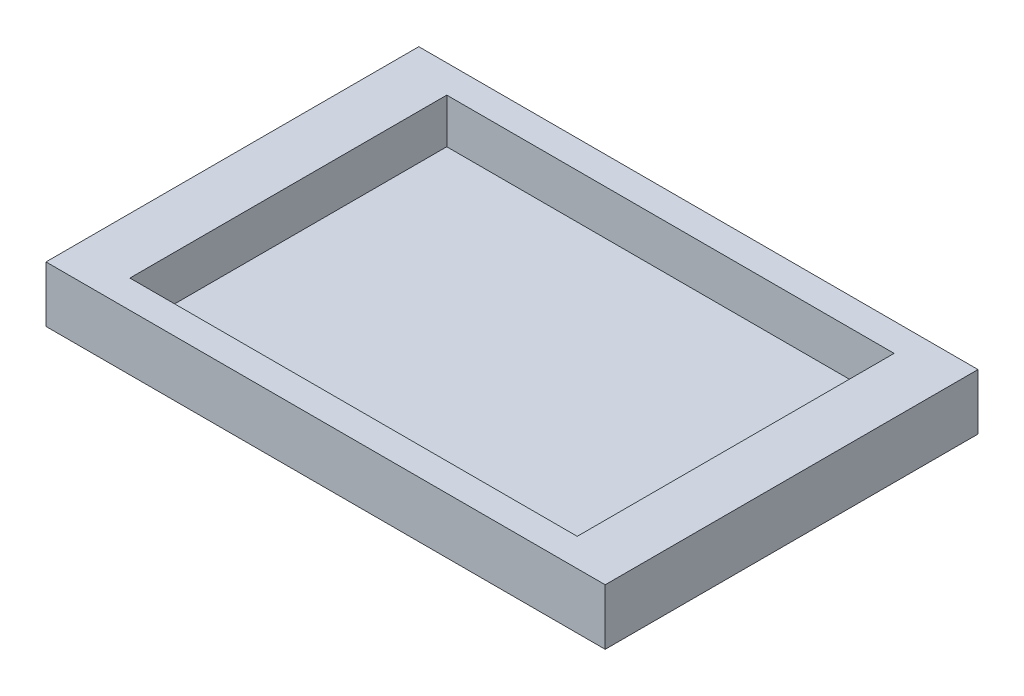
ISO-10303-21;
HEADER;
FILE_DESCRIPTION(('STEP AP214'),'2;1');
FILE_NAME('part.step','',(''),(''),'','','');
FILE_SCHEMA(('AUTOMOTIVE_DESIGN { 1 0 10303 214 1 1 1 1 }'));
ENDSEC;
DATA;
#1=APPLICATION_CONTEXT('core data for automotive mechanical design processes');
#2=APPLICATION_PROTOCOL_DEFINITION('international standard','automotive_design',2000,#1);
#3=PRODUCT_CONTEXT('',#1,'mechanical');
#4=PRODUCT('Part','Part','',(#3));
#5=PRODUCT_RELATED_PRODUCT_CATEGORY('part','',(#4));
#6=PRODUCT_DEFINITION_FORMATION('','',#4);
#7=PRODUCT_DEFINITION_CONTEXT('part definition',#1,'design');
#8=PRODUCT_DEFINITION('design','',#6,#7);
#9=PRODUCT_DEFINITION_SHAPE('','',#8);
#10=(LENGTH_UNIT() NAMED_UNIT(*) SI_UNIT(.MILLI.,.METRE.));
#11=(NAMED_UNIT(*) PLANE_ANGLE_UNIT() SI_UNIT($,.RADIAN.));
#12=(NAMED_UNIT(*) SI_UNIT($,.STERADIAN.) SOLID_ANGLE_UNIT());
#13=UNCERTAINTY_MEASURE_WITH_UNIT(LENGTH_MEASURE(1.E-05),#10,'distance_accuracy_value','');
#14=(GEOMETRIC_REPRESENTATION_CONTEXT(3) GLOBAL_UNCERTAINTY_ASSIGNED_CONTEXT((#13)) GLOBAL_UNIT_ASSIGNED_CONTEXT((#10,
#11,#12)) REPRESENTATION_CONTEXT('',''));
#15=CARTESIAN_POINT('',(0.,0.,0.));
#16=DIRECTION('',(0.,0.,1.));
#17=DIRECTION('',(1.,0.,0.));
#18=AXIS2_PLACEMENT_3D('',#15,#16,#17);
#19=CARTESIAN_POINT('',(75.,15.,-50.));
#20=DIRECTION('',(-1.,0.,0.));
#21=DIRECTION('',(0.,0.,1.));
#22=AXIS2_PLACEMENT_3D('',#19,#20,#21);
#23=PLANE('',#22);
#24=DIRECTION('',(0.,0.,-1.));
#25=VECTOR('',#24,1.);
#26=CARTESIAN_POINT('',(75.,0.,-50.));
#27=LINE('',#26,#25);
#28=CARTESIAN_POINT('',(75.,0.,50.));
#29=VERTEX_POINT('',#28);
#30=CARTESIAN_POINT('',(75.,0.,-50.));
#31=VERTEX_POINT('',#30);
#32=EDGE_CURVE('E142',#29,#31,#27,.T.);
#33=ORIENTED_EDGE('',*,*,#32,.T.);
#34=DIRECTION('',(0.,-1.,0.));
#35=VECTOR('',#34,1.);
#36=CARTESIAN_POINT('',(75.,15.,-50.));
#37=LINE('',#36,#35);
#38=CARTESIAN_POINT('',(75.,15.,-50.));
#39=VERTEX_POINT('',#38);
#40=EDGE_CURVE('E11',#39,#31,#37,.T.);
#41=ORIENTED_EDGE('',*,*,#40,.F.);
#42=DIRECTION('',(0.,0.,-1.));
#43=VECTOR('',#42,1.);
#44=CARTESIAN_POINT('',(75.,15.,-50.));
#45=LINE('',#44,#43);
#46=CARTESIAN_POINT('',(75.,15.,50.));
#47=VERTEX_POINT('',#46);
#48=EDGE_CURVE('E146',#47,#39,#45,.T.);
#49=ORIENTED_EDGE('',*,*,#48,.F.);
#50=DIRECTION('',(0.,-1.,0.));
#51=VECTOR('',#50,1.);
#52=CARTESIAN_POINT('',(75.,15.,50.));
#53=LINE('',#52,#51);
#54=EDGE_CURVE('E152',#47,#29,#53,.T.);
#55=ORIENTED_EDGE('',*,*,#54,.T.);
#56=EDGE_LOOP('',(#33,#41,#49,#55));
#57=FACE_BOUND('',#56,.T.);
#58=ADVANCED_FACE('F34',(#57),#23,.F.);
#59=CARTESIAN_POINT('',(-75.,15.,-50.));
#60=DIRECTION('',(0.,0.,1.));
#61=DIRECTION('',(1.,0.,0.));
#62=AXIS2_PLACEMENT_3D('',#59,#60,#61);
#63=PLANE('',#62);
#64=DIRECTION('',(-1.,0.,0.));
#65=VECTOR('',#64,1.);
#66=CARTESIAN_POINT('',(-75.,0.,-50.));
#67=LINE('',#66,#65);
#68=CARTESIAN_POINT('',(-75.,0.,-50.));
#69=VERTEX_POINT('',#68);
#70=EDGE_CURVE('E155',#31,#69,#67,.T.);
#71=ORIENTED_EDGE('',*,*,#70,.T.);
#72=DIRECTION('',(0.,-1.,0.));
#73=VECTOR('',#72,1.);
#74=CARTESIAN_POINT('',(-75.,15.,-50.));
#75=LINE('',#74,#73);
#76=CARTESIAN_POINT('',(-75.,15.,-50.));
#77=VERTEX_POINT('',#76);
#78=EDGE_CURVE('E41',#77,#69,#75,.T.);
#79=ORIENTED_EDGE('',*,*,#78,.F.);
#80=DIRECTION('',(-1.,0.,0.));
#81=VECTOR('',#80,1.);
#82=CARTESIAN_POINT('',(-75.,15.,-50.));
#83=LINE('',#82,#81);
#84=EDGE_CURVE('E85',#39,#77,#83,.T.);
#85=ORIENTED_EDGE('',*,*,#84,.F.);
#86=ORIENTED_EDGE('',*,*,#40,.T.);
#87=EDGE_LOOP('',(#71,#79,#85,#86));
#88=FACE_BOUND('',#87,.T.);
#89=ADVANCED_FACE('F184',(#88),#63,.F.);
#90=CARTESIAN_POINT('',(-75.,15.,-50.));
#91=DIRECTION('',(1.,0.,0.));
#92=DIRECTION('',(0.,0.,-1.));
#93=AXIS2_PLACEMENT_3D('',#90,#91,#92);
#94=PLANE('',#93);
#95=DIRECTION('',(0.,0.,1.));
#96=VECTOR('',#95,1.);
#97=CARTESIAN_POINT('',(-75.,0.,-50.));
#98=LINE('',#97,#96);
#99=CARTESIAN_POINT('',(-75.,0.,50.));
#100=VERTEX_POINT('',#99);
#101=EDGE_CURVE('E157',#69,#100,#98,.T.);
#102=ORIENTED_EDGE('',*,*,#101,.T.);
#103=DIRECTION('',(0.,-1.,0.));
#104=VECTOR('',#103,1.);
#105=CARTESIAN_POINT('',(-75.,15.,50.));
#106=LINE('',#105,#104);
#107=CARTESIAN_POINT('',(-75.,15.,50.));
#108=VERTEX_POINT('',#107);
#109=EDGE_CURVE('E161',#108,#100,#106,.T.);
#110=ORIENTED_EDGE('',*,*,#109,.F.);
#111=DIRECTION('',(0.,0.,1.));
#112=VECTOR('',#111,1.);
#113=CARTESIAN_POINT('',(-75.,15.,-50.));
#114=LINE('',#113,#112);
#115=EDGE_CURVE('E149',#77,#108,#114,.T.);
#116=ORIENTED_EDGE('',*,*,#115,.F.);
#117=ORIENTED_EDGE('',*,*,#78,.T.);
#118=EDGE_LOOP('',(#102,#110,#116,#117));
#119=FACE_BOUND('',#118,.T.);
#120=ADVANCED_FACE('F166',(#119),#94,.F.);
#121=CARTESIAN_POINT('',(-75.,15.,50.));
#122=DIRECTION('',(0.,0.,-1.));
#123=DIRECTION('',(-1.,0.,0.));
#124=AXIS2_PLACEMENT_3D('',#121,#122,#123);
#125=PLANE('',#124);
#126=DIRECTION('',(1.,0.,0.));
#127=VECTOR('',#126,1.);
#128=CARTESIAN_POINT('',(-75.,0.,50.));
#129=LINE('',#128,#127);
#130=EDGE_CURVE('E78',#100,#29,#129,.T.);
#131=ORIENTED_EDGE('',*,*,#130,.T.);
#132=ORIENTED_EDGE('',*,*,#54,.F.);
#133=DIRECTION('',(1.,0.,0.));
#134=VECTOR('',#133,1.);
#135=CARTESIAN_POINT('',(-75.,15.,50.));
#136=LINE('',#135,#134);
#137=EDGE_CURVE('E57',#108,#47,#136,.T.);
#138=ORIENTED_EDGE('',*,*,#137,.F.);
#139=ORIENTED_EDGE('',*,*,#109,.T.);
#140=EDGE_LOOP('',(#131,#132,#138,#139));
#141=FACE_BOUND('',#140,.T.);
#142=ADVANCED_FACE('F174',(#141),#125,.F.);
#143=CARTESIAN_POINT('',(0.,15.,0.));
#144=DIRECTION('',(0.,1.,0.));
#145=DIRECTION('',(0.,0.,1.));
#146=AXIS2_PLACEMENT_3D('',#143,#144,#145);
#147=PLANE('',#146);
#148=DIRECTION('',(0.,0.,1.));
#149=VECTOR('',#148,1.);
#150=CARTESIAN_POINT('',(-60.,15.,42.5));
#151=LINE('',#150,#149);
#152=CARTESIAN_POINT('',(-60.,15.,-42.5));
#153=VERTEX_POINT('',#152);
#154=CARTESIAN_POINT('',(-60.,15.,42.5));
#155=VERTEX_POINT('',#154);
#156=EDGE_CURVE('E48',#153,#155,#151,.T.);
#157=ORIENTED_EDGE('',*,*,#156,.F.);
#158=DIRECTION('',(-1.,0.,0.));
#159=VECTOR('',#158,1.);
#160=CARTESIAN_POINT('',(60.,15.,-42.5));
#161=LINE('',#160,#159);
#162=CARTESIAN_POINT('',(60.,15.,-42.5));
#163=VERTEX_POINT('',#162);
#164=EDGE_CURVE('E127',#163,#153,#161,.T.);
#165=ORIENTED_EDGE('',*,*,#164,.F.);
#166=DIRECTION('',(0.,0.,-1.));
#167=VECTOR('',#166,1.);
#168=CARTESIAN_POINT('',(60.,15.,42.5));
#169=LINE('',#168,#167);
#170=CARTESIAN_POINT('',(60.,15.,42.5));
#171=VERTEX_POINT('',#170);
#172=EDGE_CURVE('E130',#171,#163,#169,.T.);
#173=ORIENTED_EDGE('',*,*,#172,.F.);
#174=DIRECTION('',(1.,0.,0.));
#175=VECTOR('',#174,1.);
#176=CARTESIAN_POINT('',(60.,15.,42.5));
#177=LINE('',#176,#175);
#178=EDGE_CURVE('E136',#155,#171,#177,.T.);
#179=ORIENTED_EDGE('',*,*,#178,.F.);
#180=EDGE_LOOP('',(#157,#165,#173,#179));
#181=FACE_BOUND('',#180,.T.);
#182=ORIENTED_EDGE('',*,*,#48,.T.);
#183=ORIENTED_EDGE('',*,*,#84,.T.);
#184=ORIENTED_EDGE('',*,*,#115,.T.);
#185=ORIENTED_EDGE('',*,*,#137,.T.);
#186=EDGE_LOOP('',(#182,#183,#184,#185));
#187=FACE_BOUND('',#186,.T.);
#188=ADVANCED_FACE('F176',(#181,#187),#147,.T.);
#189=CARTESIAN_POINT('',(0.,0.,0.));
#190=DIRECTION('',(0.,1.,0.));
#191=DIRECTION('',(0.,0.,1.));
#192=AXIS2_PLACEMENT_3D('',#189,#190,#191);
#193=PLANE('',#192);
#194=ORIENTED_EDGE('',*,*,#32,.F.);
#195=ORIENTED_EDGE('',*,*,#130,.F.);
#196=ORIENTED_EDGE('',*,*,#101,.F.);
#197=ORIENTED_EDGE('',*,*,#70,.F.);
#198=EDGE_LOOP('',(#194,#195,#196,#197));
#199=FACE_BOUND('',#198,.T.);
#200=ADVANCED_FACE('F170',(#199),#193,.F.);
#201=CARTESIAN_POINT('',(-60.,3.,42.5));
#202=DIRECTION('',(-1.,0.,0.));
#203=DIRECTION('',(0.,0.,1.));
#204=AXIS2_PLACEMENT_3D('',#201,#202,#203);
#205=PLANE('',#204);
#206=ORIENTED_EDGE('',*,*,#156,.T.);
#207=DIRECTION('',(0.,1.,0.));
#208=VECTOR('',#207,1.);
#209=CARTESIAN_POINT('',(-60.,3.,42.5));
#210=LINE('',#209,#208);
#211=CARTESIAN_POINT('',(-60.,3.,42.5));
#212=VERTEX_POINT('',#211);
#213=EDGE_CURVE('E105',#212,#155,#210,.T.);
#214=ORIENTED_EDGE('',*,*,#213,.F.);
#215=DIRECTION('',(0.,0.,1.));
#216=VECTOR('',#215,1.);
#217=CARTESIAN_POINT('',(-60.,3.,42.5));
#218=LINE('',#217,#216);
#219=CARTESIAN_POINT('',(-60.,3.,-42.5));
#220=VERTEX_POINT('',#219);
#221=EDGE_CURVE('E109',#220,#212,#218,.T.);
#222=ORIENTED_EDGE('',*,*,#221,.F.);
#223=DIRECTION('',(0.,1.,0.));
#224=VECTOR('',#223,1.);
#225=CARTESIAN_POINT('',(-60.,3.,-42.5));
#226=LINE('',#225,#224);
#227=EDGE_CURVE('E140',#220,#153,#226,.T.);
#228=ORIENTED_EDGE('',*,*,#227,.T.);
#229=EDGE_LOOP('',(#206,#214,#222,#228));
#230=FACE_BOUND('',#229,.T.);
#231=ADVANCED_FACE('F107',(#230),#205,.F.);
#232=CARTESIAN_POINT('',(60.,3.,-42.5));
#233=DIRECTION('',(0.,0.,-1.));
#234=DIRECTION('',(-1.,0.,0.));
#235=AXIS2_PLACEMENT_3D('',#232,#233,#234);
#236=PLANE('',#235);
#237=ORIENTED_EDGE('',*,*,#164,.T.);
#238=ORIENTED_EDGE('',*,*,#227,.F.);
#239=DIRECTION('',(-1.,0.,0.));
#240=VECTOR('',#239,1.);
#241=CARTESIAN_POINT('',(60.,3.,-42.5));
#242=LINE('',#241,#240);
#243=CARTESIAN_POINT('',(60.,3.,-42.5));
#244=VERTEX_POINT('',#243);
#245=EDGE_CURVE('E115',#244,#220,#242,.T.);
#246=ORIENTED_EDGE('',*,*,#245,.F.);
#247=DIRECTION('',(0.,1.,0.));
#248=VECTOR('',#247,1.);
#249=CARTESIAN_POINT('',(60.,3.,-42.5));
#250=LINE('',#249,#248);
#251=EDGE_CURVE('E143',#244,#163,#250,.T.);
#252=ORIENTED_EDGE('',*,*,#251,.T.);
#253=EDGE_LOOP('',(#237,#238,#246,#252));
#254=FACE_BOUND('',#253,.T.);
#255=ADVANCED_FACE('F223',(#254),#236,.F.);
#256=CARTESIAN_POINT('',(60.,3.,42.5));
#257=DIRECTION('',(1.,0.,0.));
#258=DIRECTION('',(0.,0.,-1.));
#259=AXIS2_PLACEMENT_3D('',#256,#257,#258);
#260=PLANE('',#259);
#261=ORIENTED_EDGE('',*,*,#172,.T.);
#262=ORIENTED_EDGE('',*,*,#251,.F.);
#263=DIRECTION('',(0.,0.,-1.));
#264=VECTOR('',#263,1.);
#265=CARTESIAN_POINT('',(60.,3.,42.5));
#266=LINE('',#265,#264);
#267=CARTESIAN_POINT('',(60.,3.,42.5));
#268=VERTEX_POINT('',#267);
#269=EDGE_CURVE('E123',#268,#244,#266,.T.);
#270=ORIENTED_EDGE('',*,*,#269,.F.);
#271=DIRECTION('',(0.,1.,0.));
#272=VECTOR('',#271,1.);
#273=CARTESIAN_POINT('',(60.,3.,42.5));
#274=LINE('',#273,#272);
#275=EDGE_CURVE('E114',#268,#171,#274,.T.);
#276=ORIENTED_EDGE('',*,*,#275,.T.);
#277=EDGE_LOOP('',(#261,#262,#270,#276));
#278=FACE_BOUND('',#277,.T.);
#279=ADVANCED_FACE('F232',(#278),#260,.F.);
#280=CARTESIAN_POINT('',(60.,3.,42.5));
#281=DIRECTION('',(0.,0.,1.));
#282=DIRECTION('',(1.,0.,0.));
#283=AXIS2_PLACEMENT_3D('',#280,#281,#282);
#284=PLANE('',#283);
#285=ORIENTED_EDGE('',*,*,#178,.T.);
#286=ORIENTED_EDGE('',*,*,#275,.F.);
#287=DIRECTION('',(1.,0.,0.));
#288=VECTOR('',#287,1.);
#289=CARTESIAN_POINT('',(60.,3.,42.5));
#290=LINE('',#289,#288);
#291=EDGE_CURVE('E118',#212,#268,#290,.T.);
#292=ORIENTED_EDGE('',*,*,#291,.F.);
#293=ORIENTED_EDGE('',*,*,#213,.T.);
#294=EDGE_LOOP('',(#285,#286,#292,#293));
#295=FACE_BOUND('',#294,.T.);
#296=ADVANCED_FACE('F119',(#295),#284,.F.);
#297=CARTESIAN_POINT('',(0.,3.,0.));
#298=DIRECTION('',(0.,1.,0.));
#299=DIRECTION('',(0.,0.,1.));
#300=AXIS2_PLACEMENT_3D('',#297,#298,#299);
#301=PLANE('',#300);
#302=ORIENTED_EDGE('',*,*,#221,.T.);
#303=ORIENTED_EDGE('',*,*,#291,.T.);
#304=ORIENTED_EDGE('',*,*,#269,.T.);
#305=ORIENTED_EDGE('',*,*,#245,.T.);
#306=EDGE_LOOP('',(#302,#303,#304,#305));
#307=FACE_BOUND('',#306,.T.);
#308=ADVANCED_FACE('F125',(#307),#301,.T.);
#309=CLOSED_SHELL('',(#58,#89,#120,#142,#188,#200,#231,#255,#279,#296,#308));
#310=MANIFOLD_SOLID_BREP('B2',#309);
#311=ADVANCED_BREP_SHAPE_REPRESENTATION('',(#18,#310),#14);
#312=SHAPE_DEFINITION_REPRESENTATION(#9,#311);
ENDSEC;
END-ISO-10303-21;
